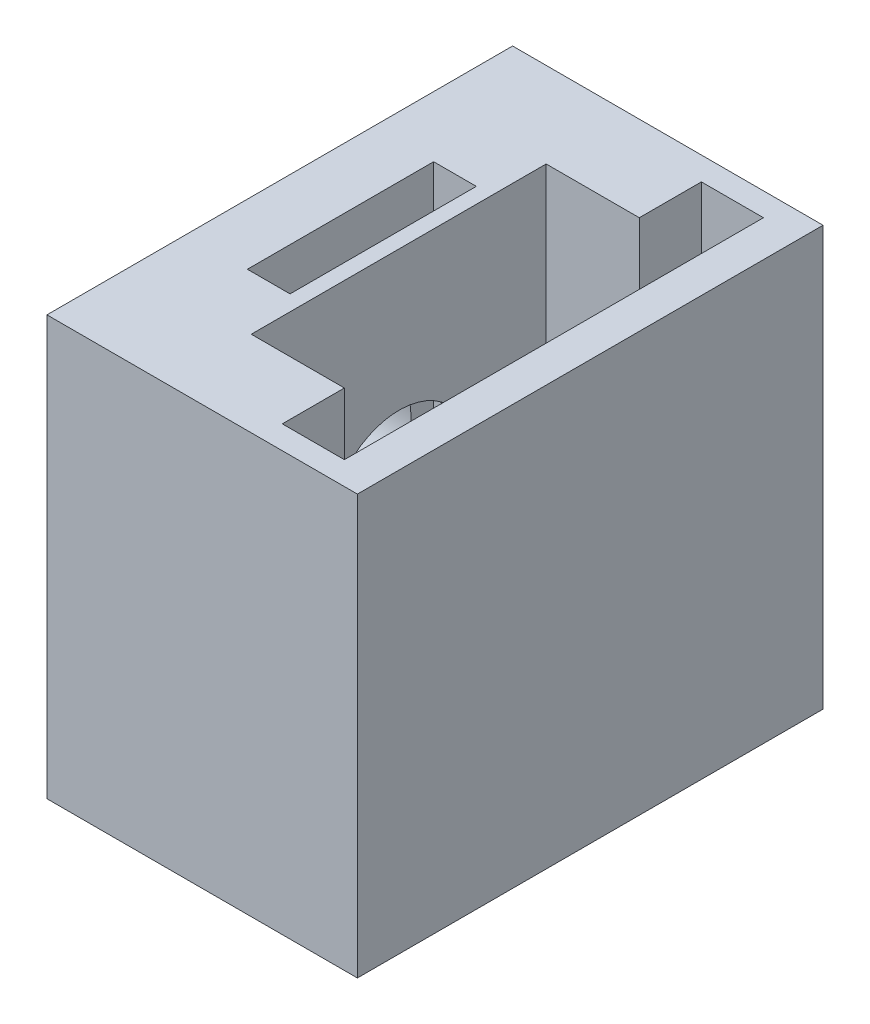
ISO-10303-21;
HEADER;
FILE_DESCRIPTION(('STEP AP214'),'2;1');
FILE_NAME('part.step','',(''),(''),'','','');
FILE_SCHEMA(('AUTOMOTIVE_DESIGN { 1 0 10303 214 1 1 1 1 }'));
ENDSEC;
DATA;
#1=APPLICATION_CONTEXT('core data for automotive mechanical design processes');
#2=APPLICATION_PROTOCOL_DEFINITION('international standard','automotive_design',2000,#1);
#3=PRODUCT_CONTEXT('',#1,'mechanical');
#4=PRODUCT('Part','Part','',(#3));
#5=PRODUCT_RELATED_PRODUCT_CATEGORY('part','',(#4));
#6=PRODUCT_DEFINITION_FORMATION('','',#4);
#7=PRODUCT_DEFINITION_CONTEXT('part definition',#1,'design');
#8=PRODUCT_DEFINITION('design','',#6,#7);
#9=PRODUCT_DEFINITION_SHAPE('','',#8);
#10=(LENGTH_UNIT() NAMED_UNIT(*) SI_UNIT(.MILLI.,.METRE.));
#11=(NAMED_UNIT(*) PLANE_ANGLE_UNIT() SI_UNIT($,.RADIAN.));
#12=(NAMED_UNIT(*) SI_UNIT($,.STERADIAN.) SOLID_ANGLE_UNIT());
#13=UNCERTAINTY_MEASURE_WITH_UNIT(LENGTH_MEASURE(1.E-05),#10,'distance_accuracy_value','');
#14=(GEOMETRIC_REPRESENTATION_CONTEXT(3) GLOBAL_UNCERTAINTY_ASSIGNED_CONTEXT((#13)) GLOBAL_UNIT_ASSIGNED_CONTEXT((#10,
#11,#12)) REPRESENTATION_CONTEXT('',''));
#15=CARTESIAN_POINT('',(0.,0.,0.));
#16=DIRECTION('',(0.,0.,1.));
#17=DIRECTION('',(1.,0.,0.));
#18=AXIS2_PLACEMENT_3D('',#15,#16,#17);
#19=CARTESIAN_POINT('',(0.,9.5,0.));
#20=DIRECTION('',(0.,1.,0.));
#21=DIRECTION('',(0.,0.,1.));
#22=AXIS2_PLACEMENT_3D('',#19,#20,#21);
#23=PLANE('',#22);
#24=DIRECTION('',(-1.,0.,0.));
#25=VECTOR('',#24,1.);
#26=CARTESIAN_POINT('',(10.5,9.5,-17.1015528128088));
#27=LINE('',#26,#25);
#28=CARTESIAN_POINT('',(6.66196126146727,9.5,-17.1015528128088));
#29=VERTEX_POINT('',#28);
#30=CARTESIAN_POINT('',(3.91196126146727,9.5,-17.1015528128088));
#31=VERTEX_POINT('',#30);
#32=EDGE_CURVE('E11',#29,#31,#27,.T.);
#33=ORIENTED_EDGE('',*,*,#32,.F.);
#34=DIRECTION('',(0.,0.,-1.));
#35=VECTOR('',#34,1.);
#36=CARTESIAN_POINT('',(6.66196126146727,9.5,-21.));
#37=LINE('',#36,#35);
#38=CARTESIAN_POINT('',(6.66196126146727,9.5,-21.));
#39=VERTEX_POINT('',#38);
#40=EDGE_CURVE('E173',#29,#39,#37,.T.);
#41=ORIENTED_EDGE('',*,*,#40,.T.);
#42=DIRECTION('',(-1.,0.,0.));
#43=VECTOR('',#42,1.);
#44=CARTESIAN_POINT('',(3.91196126146727,9.5,-21.));
#45=LINE('',#44,#43);
#46=CARTESIAN_POINT('',(3.91196126146727,9.5,-21.));
#47=VERTEX_POINT('',#46);
#48=EDGE_CURVE('E179',#39,#47,#45,.T.);
#49=ORIENTED_EDGE('',*,*,#48,.T.);
#50=DIRECTION('',(0.,0.,1.));
#51=VECTOR('',#50,1.);
#52=CARTESIAN_POINT('',(3.91196126146727,9.5,-21.));
#53=LINE('',#52,#51);
#54=EDGE_CURVE('E588',#47,#31,#53,.T.);
#55=ORIENTED_EDGE('',*,*,#54,.T.);
#56=EDGE_LOOP('',(#33,#41,#49,#55));
#57=FACE_BOUND('',#56,.T.);
#58=ADVANCED_FACE('F35',(#57),#23,.T.);
#59=CARTESIAN_POINT('',(20.,27.,0.));
#60=DIRECTION('',(0.,-1.,0.));
#61=DIRECTION('',(0.,0.,-1.));
#62=AXIS2_PLACEMENT_3D('',#59,#60,#61);
#63=PLANE('',#62);
#64=DIRECTION('',(1.,0.,0.));
#65=VECTOR('',#64,1.);
#66=CARTESIAN_POINT('',(3.91196126146727,27.,-8.99999999999999));
#67=LINE('',#66,#65);
#68=CARTESIAN_POINT('',(3.91196126146727,27.,-8.99999999999999));
#69=VERTEX_POINT('',#68);
#70=CARTESIAN_POINT('',(6.66196126146727,27.,-8.99999999999999));
#71=VERTEX_POINT('',#70);
#72=EDGE_CURVE('E188',#69,#71,#67,.T.);
#73=ORIENTED_EDGE('',*,*,#72,.F.);
#74=DIRECTION('',(0.,0.,1.));
#75=VECTOR('',#74,1.);
#76=CARTESIAN_POINT('',(3.91196126146727,27.,-21.));
#77=LINE('',#76,#75);
#78=CARTESIAN_POINT('',(3.91196126146727,27.,-21.));
#79=VERTEX_POINT('',#78);
#80=EDGE_CURVE('E57',#79,#69,#77,.T.);
#81=ORIENTED_EDGE('',*,*,#80,.F.);
#82=DIRECTION('',(-1.,0.,0.));
#83=VECTOR('',#82,1.);
#84=CARTESIAN_POINT('',(3.91196126146727,27.,-21.));
#85=LINE('',#84,#83);
#86=CARTESIAN_POINT('',(6.66196126146727,27.,-21.));
#87=VERTEX_POINT('',#86);
#88=EDGE_CURVE('E195',#87,#79,#85,.T.);
#89=ORIENTED_EDGE('',*,*,#88,.F.);
#90=DIRECTION('',(0.,0.,-1.));
#91=VECTOR('',#90,1.);
#92=CARTESIAN_POINT('',(6.66196126146727,27.,-21.));
#93=LINE('',#92,#91);
#94=EDGE_CURVE('E192',#71,#87,#93,.T.);
#95=ORIENTED_EDGE('',*,*,#94,.F.);
#96=EDGE_LOOP('',(#73,#81,#89,#95));
#97=FACE_BOUND('',#96,.T.);
#98=DIRECTION('',(0.,0.,1.));
#99=VECTOR('',#98,1.);
#100=CARTESIAN_POINT('',(0.,27.,0.));
#101=LINE('',#100,#99);
#102=CARTESIAN_POINT('',(0.,27.,-30.));
#103=VERTEX_POINT('',#102);
#104=CARTESIAN_POINT('',(0.,27.,0.));
#105=VERTEX_POINT('',#104);
#106=EDGE_CURVE('E279',#103,#105,#101,.T.);
#107=ORIENTED_EDGE('',*,*,#106,.T.);
#108=DIRECTION('',(-1.,0.,0.));
#109=VECTOR('',#108,1.);
#110=CARTESIAN_POINT('',(20.,27.,0.));
#111=LINE('',#110,#109);
#112=CARTESIAN_POINT('',(20.,27.,0.));
#113=VERTEX_POINT('',#112);
#114=EDGE_CURVE('E285',#113,#105,#111,.T.);
#115=ORIENTED_EDGE('',*,*,#114,.F.);
#116=DIRECTION('',(0.,0.,1.));
#117=VECTOR('',#116,1.);
#118=CARTESIAN_POINT('',(20.,27.,0.));
#119=LINE('',#118,#117);
#120=CARTESIAN_POINT('',(20.,27.,-30.));
#121=VERTEX_POINT('',#120);
#122=EDGE_CURVE('E283',#121,#113,#119,.T.);
#123=ORIENTED_EDGE('',*,*,#122,.F.);
#124=DIRECTION('',(-1.,0.,0.));
#125=VECTOR('',#124,1.);
#126=CARTESIAN_POINT('',(20.,27.,-30.));
#127=LINE('',#126,#125);
#128=EDGE_CURVE('E295',#121,#103,#127,.T.);
#129=ORIENTED_EDGE('',*,*,#128,.T.);
#130=EDGE_LOOP('',(#107,#115,#123,#129));
#131=FACE_BOUND('',#130,.T.);
#132=DIRECTION('',(0.,0.,1.));
#133=VECTOR('',#132,1.);
#134=CARTESIAN_POINT('',(7.66196126146727,27.,-24.5));
#135=LINE('',#134,#133);
#136=CARTESIAN_POINT('',(7.66196126146727,27.,-24.5));
#137=VERTEX_POINT('',#136);
#138=CARTESIAN_POINT('',(7.66196126146727,27.,-5.5));
#139=VERTEX_POINT('',#138);
#140=EDGE_CURVE('E210',#137,#139,#135,.T.);
#141=ORIENTED_EDGE('',*,*,#140,.F.);
#142=DIRECTION('',(-1.,0.,0.));
#143=VECTOR('',#142,1.);
#144=CARTESIAN_POINT('',(7.66196126146727,27.,-24.5));
#145=LINE('',#144,#143);
#146=CARTESIAN_POINT('',(13.6619612614673,27.,-24.5));
#147=VERTEX_POINT('',#146);
#148=EDGE_CURVE('E217',#147,#137,#145,.T.);
#149=ORIENTED_EDGE('',*,*,#148,.F.);
#150=DIRECTION('',(0.,0.,1.));
#151=VECTOR('',#150,1.);
#152=CARTESIAN_POINT('',(13.6619612614673,26.9999999999758,-28.5));
#153=LINE('',#152,#151);
#154=CARTESIAN_POINT('',(13.6619612614673,27.,-28.5));
#155=VERTEX_POINT('',#154);
#156=EDGE_CURVE('E244',#155,#147,#153,.T.);
#157=ORIENTED_EDGE('',*,*,#156,.F.);
#158=DIRECTION('',(1.,0.,0.));
#159=VECTOR('',#158,1.);
#160=CARTESIAN_POINT('',(13.6619612614673,26.9999999999758,-28.5));
#161=LINE('',#160,#159);
#162=CARTESIAN_POINT('',(17.6619612614673,26.9999999999758,-28.5));
#163=VERTEX_POINT('',#162);
#164=EDGE_CURVE('E233',#155,#163,#161,.T.);
#165=ORIENTED_EDGE('',*,*,#164,.T.);
#166=DIRECTION('',(0.,0.,1.));
#167=VECTOR('',#166,1.);
#168=CARTESIAN_POINT('',(17.6619612614673,26.9999999999758,-28.5));
#169=LINE('',#168,#167);
#170=CARTESIAN_POINT('',(17.6619612614673,26.9999999999758,-1.5));
#171=VERTEX_POINT('',#170);
#172=EDGE_CURVE('E255',#163,#171,#169,.T.);
#173=ORIENTED_EDGE('',*,*,#172,.T.);
#174=DIRECTION('',(1.,0.,0.));
#175=VECTOR('',#174,1.);
#176=CARTESIAN_POINT('',(13.6619612614673,26.9999999999758,-1.5));
#177=LINE('',#176,#175);
#178=CARTESIAN_POINT('',(13.6619612614673,26.9999999999758,-1.5));
#179=VERTEX_POINT('',#178);
#180=EDGE_CURVE('E258',#179,#171,#177,.T.);
#181=ORIENTED_EDGE('',*,*,#180,.F.);
#182=CARTESIAN_POINT('',(13.6619612614673,27.,-5.5));
#183=VERTEX_POINT('',#182);
#184=EDGE_CURVE('E261',#183,#179,#153,.T.);
#185=ORIENTED_EDGE('',*,*,#184,.F.);
#186=DIRECTION('',(1.,0.,0.));
#187=VECTOR('',#186,1.);
#188=CARTESIAN_POINT('',(7.66196126146727,27.,-5.5));
#189=LINE('',#188,#187);
#190=EDGE_CURVE('E227',#139,#183,#189,.T.);
#191=ORIENTED_EDGE('',*,*,#190,.F.);
#192=EDGE_LOOP('',(#141,#149,#157,#165,#173,#181,#185,#191));
#193=FACE_BOUND('',#192,.T.);
#194=ADVANCED_FACE('F320',(#97,#131,#193),#63,.F.);
#195=CARTESIAN_POINT('',(20.,0.,0.));
#196=DIRECTION('',(0.,0.,-1.));
#197=DIRECTION('',(0.,1.,0.));
#198=AXIS2_PLACEMENT_3D('',#195,#196,#197);
#199=PLANE('',#198);
#200=DIRECTION('',(0.,-1.,0.));
#201=VECTOR('',#200,1.);
#202=CARTESIAN_POINT('',(0.,0.,0.));
#203=LINE('',#202,#201);
#204=CARTESIAN_POINT('',(0.,0.,0.));
#205=VERTEX_POINT('',#204);
#206=EDGE_CURVE('E274',#105,#205,#203,.T.);
#207=ORIENTED_EDGE('',*,*,#206,.T.);
#208=DIRECTION('',(-1.,0.,0.));
#209=VECTOR('',#208,1.);
#210=CARTESIAN_POINT('',(20.,0.,0.));
#211=LINE('',#210,#209);
#212=CARTESIAN_POINT('',(20.,0.,0.));
#213=VERTEX_POINT('',#212);
#214=EDGE_CURVE('E165',#213,#205,#211,.T.);
#215=ORIENTED_EDGE('',*,*,#214,.F.);
#216=DIRECTION('',(0.,-1.,0.));
#217=VECTOR('',#216,1.);
#218=CARTESIAN_POINT('',(20.,0.,0.));
#219=LINE('',#218,#217);
#220=EDGE_CURVE('E275',#113,#213,#219,.T.);
#221=ORIENTED_EDGE('',*,*,#220,.F.);
#222=ORIENTED_EDGE('',*,*,#114,.T.);
#223=EDGE_LOOP('',(#207,#215,#221,#222));
#224=FACE_BOUND('',#223,.T.);
#225=ADVANCED_FACE('F37',(#224),#199,.F.);
#226=CARTESIAN_POINT('',(20.,0.,0.));
#227=DIRECTION('',(0.,1.,0.));
#228=DIRECTION('',(0.,0.,1.));
#229=AXIS2_PLACEMENT_3D('',#226,#227,#228);
#230=PLANE('',#229);
#231=DIRECTION('',(0.,0.,-1.));
#232=VECTOR('',#231,1.);
#233=CARTESIAN_POINT('',(0.,0.,0.));
#234=LINE('',#233,#232);
#235=CARTESIAN_POINT('',(0.,0.,-30.));
#236=VERTEX_POINT('',#235);
#237=EDGE_CURVE('E288',#205,#236,#234,.T.);
#238=ORIENTED_EDGE('',*,*,#237,.T.);
#239=DIRECTION('',(-1.,0.,0.));
#240=VECTOR('',#239,1.);
#241=CARTESIAN_POINT('',(20.,0.,-30.));
#242=LINE('',#241,#240);
#243=CARTESIAN_POINT('',(20.,0.,-30.));
#244=VERTEX_POINT('',#243);
#245=EDGE_CURVE('E298',#244,#236,#242,.T.);
#246=ORIENTED_EDGE('',*,*,#245,.F.);
#247=DIRECTION('',(0.,0.,-1.));
#248=VECTOR('',#247,1.);
#249=CARTESIAN_POINT('',(20.,0.,0.));
#250=LINE('',#249,#248);
#251=EDGE_CURVE('E278',#213,#244,#250,.T.);
#252=ORIENTED_EDGE('',*,*,#251,.F.);
#253=ORIENTED_EDGE('',*,*,#214,.T.);
#254=EDGE_LOOP('',(#238,#246,#252,#253));
#255=FACE_BOUND('',#254,.T.);
#256=ADVANCED_FACE('F304',(#255),#230,.F.);
#257=CARTESIAN_POINT('',(20.,0.,-30.));
#258=DIRECTION('',(0.,0.,1.));
#259=DIRECTION('',(1.,0.,0.));
#260=AXIS2_PLACEMENT_3D('',#257,#258,#259);
#261=PLANE('',#260);
#262=DIRECTION('',(0.,1.,0.));
#263=VECTOR('',#262,1.);
#264=CARTESIAN_POINT('',(0.,0.,-30.));
#265=LINE('',#264,#263);
#266=EDGE_CURVE('E290',#236,#103,#265,.T.);
#267=ORIENTED_EDGE('',*,*,#266,.T.);
#268=ORIENTED_EDGE('',*,*,#128,.F.);
#269=DIRECTION('',(0.,1.,0.));
#270=VECTOR('',#269,1.);
#271=CARTESIAN_POINT('',(20.,0.,-30.));
#272=LINE('',#271,#270);
#273=EDGE_CURVE('E281',#244,#121,#272,.T.);
#274=ORIENTED_EDGE('',*,*,#273,.F.);
#275=ORIENTED_EDGE('',*,*,#245,.T.);
#276=EDGE_LOOP('',(#267,#268,#274,#275));
#277=FACE_BOUND('',#276,.T.);
#278=ADVANCED_FACE('F316',(#277),#261,.F.);
#279=CARTESIAN_POINT('',(20.,0.,0.));
#280=DIRECTION('',(-1.,0.,0.));
#281=DIRECTION('',(0.,0.,1.));
#282=AXIS2_PLACEMENT_3D('',#279,#280,#281);
#283=PLANE('',#282);
#284=ORIENTED_EDGE('',*,*,#220,.T.);
#285=ORIENTED_EDGE('',*,*,#251,.T.);
#286=ORIENTED_EDGE('',*,*,#273,.T.);
#287=ORIENTED_EDGE('',*,*,#122,.T.);
#288=EDGE_LOOP('',(#284,#285,#286,#287));
#289=FACE_BOUND('',#288,.T.);
#290=ADVANCED_FACE('F323',(#289),#283,.F.);
#291=CARTESIAN_POINT('',(0.,0.,0.));
#292=DIRECTION('',(-1.,0.,0.));
#293=DIRECTION('',(0.,0.,1.));
#294=AXIS2_PLACEMENT_3D('',#291,#292,#293);
#295=PLANE('',#294);
#296=CARTESIAN_POINT('',(0.,13.5,-15.1));
#297=DIRECTION('',(-1.,0.,0.));
#298=DIRECTION('',(0.,0.,1.));
#299=AXIS2_PLACEMENT_3D('',#296,#297,#298);
#300=CIRCLE('',#299,5.);
#301=CARTESIAN_POINT('',(0.,13.5,-10.1));
#302=VERTEX_POINT('',#301);
#303=EDGE_CURVE('E201',#302,#302,#300,.T.);
#304=ORIENTED_EDGE('',*,*,#303,.F.);
#305=EDGE_LOOP('',(#304));
#306=FACE_BOUND('',#305,.T.);
#307=ORIENTED_EDGE('',*,*,#206,.F.);
#308=ORIENTED_EDGE('',*,*,#106,.F.);
#309=ORIENTED_EDGE('',*,*,#266,.F.);
#310=ORIENTED_EDGE('',*,*,#237,.F.);
#311=EDGE_LOOP('',(#307,#308,#309,#310));
#312=FACE_BOUND('',#311,.T.);
#313=ADVANCED_FACE('F312',(#306,#312),#295,.T.);
#314=CARTESIAN_POINT('',(13.6619612614673,0.999999999975808,-28.5));
#315=DIRECTION('',(0.,0.,1.));
#316=DIRECTION('',(1.,0.,0.));
#317=AXIS2_PLACEMENT_3D('',#314,#315,#316);
#318=PLANE('',#317);
#319=ORIENTED_EDGE('',*,*,#164,.F.);
#320=DIRECTION('',(0.,1.,0.));
#321=VECTOR('',#320,1.);
#322=CARTESIAN_POINT('',(13.6619612614673,0.999999999975808,-28.5));
#323=LINE('',#322,#321);
#324=CARTESIAN_POINT('',(13.6619612614673,0.999999999975808,-28.5));
#325=VERTEX_POINT('',#324);
#326=EDGE_CURVE('E252',#325,#155,#323,.T.);
#327=ORIENTED_EDGE('',*,*,#326,.F.);
#328=DIRECTION('',(1.,0.,0.));
#329=VECTOR('',#328,1.);
#330=CARTESIAN_POINT('',(13.6619612614673,0.999999999975808,-28.5));
#331=LINE('',#330,#329);
#332=CARTESIAN_POINT('',(17.6619612614673,0.999999999975808,-28.5));
#333=VERTEX_POINT('',#332);
#334=EDGE_CURVE('E240',#325,#333,#331,.T.);
#335=ORIENTED_EDGE('',*,*,#334,.T.);
#336=DIRECTION('',(0.,1.,0.));
#337=VECTOR('',#336,1.);
#338=CARTESIAN_POINT('',(17.6619612614673,0.999999999975808,-28.5));
#339=LINE('',#338,#337);
#340=EDGE_CURVE('E271',#333,#163,#339,.T.);
#341=ORIENTED_EDGE('',*,*,#340,.T.);
#342=EDGE_LOOP('',(#319,#327,#335,#341));
#343=FACE_BOUND('',#342,.T.);
#344=ADVANCED_FACE('F330',(#343),#318,.T.);
#345=CARTESIAN_POINT('',(17.6619612614673,0.999999999975808,-28.5));
#346=DIRECTION('',(-1.,0.,0.));
#347=DIRECTION('',(0.,0.,1.));
#348=AXIS2_PLACEMENT_3D('',#345,#346,#347);
#349=PLANE('',#348);
#350=ORIENTED_EDGE('',*,*,#172,.F.);
#351=ORIENTED_EDGE('',*,*,#340,.F.);
#352=DIRECTION('',(0.,0.,1.));
#353=VECTOR('',#352,1.);
#354=CARTESIAN_POINT('',(17.6619612614673,0.999999999975808,-28.5));
#355=LINE('',#354,#353);
#356=CARTESIAN_POINT('',(17.6619612614673,0.999999999975808,-1.5));
#357=VERTEX_POINT('',#356);
#358=EDGE_CURVE('E243',#333,#357,#355,.T.);
#359=ORIENTED_EDGE('',*,*,#358,.T.);
#360=DIRECTION('',(0.,1.,0.));
#361=VECTOR('',#360,1.);
#362=CARTESIAN_POINT('',(17.6619612614673,0.999999999975808,-1.5));
#363=LINE('',#362,#361);
#364=EDGE_CURVE('E269',#357,#171,#363,.T.);
#365=ORIENTED_EDGE('',*,*,#364,.T.);
#366=EDGE_LOOP('',(#350,#351,#359,#365));
#367=FACE_BOUND('',#366,.T.);
#368=ADVANCED_FACE('F398',(#367),#349,.T.);
#369=CARTESIAN_POINT('',(13.6619612614673,0.999999999975808,-1.5));
#370=DIRECTION('',(0.,0.,1.));
#371=DIRECTION('',(1.,0.,0.));
#372=AXIS2_PLACEMENT_3D('',#369,#370,#371);
#373=PLANE('',#372);
#374=ORIENTED_EDGE('',*,*,#180,.T.);
#375=ORIENTED_EDGE('',*,*,#364,.F.);
#376=DIRECTION('',(1.,0.,0.));
#377=VECTOR('',#376,1.);
#378=CARTESIAN_POINT('',(13.6619612614673,0.999999999975808,-1.5));
#379=LINE('',#378,#377);
#380=CARTESIAN_POINT('',(13.6619612614673,0.999999999975808,-1.5));
#381=VERTEX_POINT('',#380);
#382=EDGE_CURVE('E246',#381,#357,#379,.T.);
#383=ORIENTED_EDGE('',*,*,#382,.F.);
#384=DIRECTION('',(0.,1.,0.));
#385=VECTOR('',#384,1.);
#386=CARTESIAN_POINT('',(13.6619612614673,0.999999999975808,-1.5));
#387=LINE('',#386,#385);
#388=EDGE_CURVE('E266',#381,#179,#387,.T.);
#389=ORIENTED_EDGE('',*,*,#388,.T.);
#390=EDGE_LOOP('',(#374,#375,#383,#389));
#391=FACE_BOUND('',#390,.T.);
#392=ADVANCED_FACE('F394',(#391),#373,.F.);
#393=CARTESIAN_POINT('',(13.6619612614673,0.999999999975808,-28.5));
#394=DIRECTION('',(-1.,0.,0.));
#395=DIRECTION('',(0.,0.,1.));
#396=AXIS2_PLACEMENT_3D('',#393,#394,#395);
#397=PLANE('',#396);
#398=ORIENTED_EDGE('',*,*,#156,.T.);
#399=DIRECTION('',(0.,1.,0.));
#400=VECTOR('',#399,1.);
#401=CARTESIAN_POINT('',(13.6619612614673,7.,-24.5));
#402=LINE('',#401,#400);
#403=CARTESIAN_POINT('',(13.6619612614673,7.,-24.5));
#404=VERTEX_POINT('',#403);
#405=EDGE_CURVE('E234',#404,#147,#402,.T.);
#406=ORIENTED_EDGE('',*,*,#405,.F.);
#407=DIRECTION('',(0.,0.,-1.));
#408=VECTOR('',#407,1.);
#409=CARTESIAN_POINT('',(13.6619612614673,7.,-24.5));
#410=LINE('',#409,#408);
#411=CARTESIAN_POINT('',(13.6619612614673,7.,-5.5));
#412=VERTEX_POINT('',#411);
#413=EDGE_CURVE('E219',#412,#404,#410,.T.);
#414=ORIENTED_EDGE('',*,*,#413,.F.);
#415=DIRECTION('',(0.,1.,0.));
#416=VECTOR('',#415,1.);
#417=CARTESIAN_POINT('',(13.6619612614673,7.,-5.5));
#418=LINE('',#417,#416);
#419=EDGE_CURVE('E236',#412,#183,#418,.T.);
#420=ORIENTED_EDGE('',*,*,#419,.T.);
#421=ORIENTED_EDGE('',*,*,#184,.T.);
#422=ORIENTED_EDGE('',*,*,#388,.F.);
#423=DIRECTION('',(0.,0.,1.));
#424=VECTOR('',#423,1.);
#425=CARTESIAN_POINT('',(13.6619612614673,0.999999999975808,-28.5));
#426=LINE('',#425,#424);
#427=EDGE_CURVE('E249',#325,#381,#426,.T.);
#428=ORIENTED_EDGE('',*,*,#427,.F.);
#429=ORIENTED_EDGE('',*,*,#326,.T.);
#430=EDGE_LOOP('',(#398,#406,#414,#420,#421,#422,#428,#429));
#431=FACE_BOUND('',#430,.T.);
#432=ADVANCED_FACE('F390',(#431),#397,.F.);
#433=CARTESIAN_POINT('',(0.,0.999999999975808,0.));
#434=DIRECTION('',(0.,-1.,0.));
#435=DIRECTION('',(0.,0.,-1.));
#436=AXIS2_PLACEMENT_3D('',#433,#434,#435);
#437=PLANE('',#436);
#438=ORIENTED_EDGE('',*,*,#334,.F.);
#439=ORIENTED_EDGE('',*,*,#427,.T.);
#440=ORIENTED_EDGE('',*,*,#382,.T.);
#441=ORIENTED_EDGE('',*,*,#358,.F.);
#442=EDGE_LOOP('',(#438,#439,#440,#441));
#443=FACE_BOUND('',#442,.T.);
#444=ADVANCED_FACE('F386',(#443),#437,.F.);
#445=CARTESIAN_POINT('',(7.66196126146727,7.,-24.5));
#446=DIRECTION('',(-1.,0.,0.));
#447=DIRECTION('',(0.,0.,1.));
#448=AXIS2_PLACEMENT_3D('',#445,#446,#447);
#449=PLANE('',#448);
#450=CARTESIAN_POINT('',(7.66196126146727,13.5,-15.04));
#451=DIRECTION('',(-1.,0.,0.));
#452=DIRECTION('',(0.,0.,1.));
#453=AXIS2_PLACEMENT_3D('',#450,#451,#452);
#454=CIRCLE('',#453,4.5);
#455=CARTESIAN_POINT('',(7.66196126146727,13.5,-10.54));
#456=VERTEX_POINT('',#455);
#457=EDGE_CURVE('E189',#456,#456,#454,.T.);
#458=ORIENTED_EDGE('',*,*,#457,.T.);
#459=EDGE_LOOP('',(#458));
#460=FACE_BOUND('',#459,.T.);
#461=ORIENTED_EDGE('',*,*,#140,.T.);
#462=DIRECTION('',(0.,1.,0.));
#463=VECTOR('',#462,1.);
#464=CARTESIAN_POINT('',(7.66196126146727,7.,-5.5));
#465=LINE('',#464,#463);
#466=CARTESIAN_POINT('',(7.66196126146727,7.,-5.5));
#467=VERTEX_POINT('',#466);
#468=EDGE_CURVE('E224',#467,#139,#465,.T.);
#469=ORIENTED_EDGE('',*,*,#468,.F.);
#470=DIRECTION('',(0.,0.,1.));
#471=VECTOR('',#470,1.);
#472=CARTESIAN_POINT('',(7.66196126146727,7.,-24.5));
#473=LINE('',#472,#471);
#474=CARTESIAN_POINT('',(7.66196126146727,7.,-24.5));
#475=VERTEX_POINT('',#474);
#476=EDGE_CURVE('E213',#475,#467,#473,.T.);
#477=ORIENTED_EDGE('',*,*,#476,.F.);
#478=DIRECTION('',(0.,1.,0.));
#479=VECTOR('',#478,1.);
#480=CARTESIAN_POINT('',(7.66196126146727,7.,-24.5));
#481=LINE('',#480,#479);
#482=EDGE_CURVE('E231',#475,#137,#481,.T.);
#483=ORIENTED_EDGE('',*,*,#482,.T.);
#484=EDGE_LOOP('',(#461,#469,#477,#483));
#485=FACE_BOUND('',#484,.T.);
#486=ADVANCED_FACE('F379',(#460,#485),#449,.F.);
#487=CARTESIAN_POINT('',(7.66196126146727,7.,-24.5));
#488=DIRECTION('',(0.,0.,-1.));
#489=DIRECTION('',(-1.,0.,0.));
#490=AXIS2_PLACEMENT_3D('',#487,#488,#489);
#491=PLANE('',#490);
#492=ORIENTED_EDGE('',*,*,#148,.T.);
#493=ORIENTED_EDGE('',*,*,#482,.F.);
#494=DIRECTION('',(-1.,0.,0.));
#495=VECTOR('',#494,1.);
#496=CARTESIAN_POINT('',(7.66196126146727,7.,-24.5));
#497=LINE('',#496,#495);
#498=EDGE_CURVE('E221',#404,#475,#497,.T.);
#499=ORIENTED_EDGE('',*,*,#498,.F.);
#500=ORIENTED_EDGE('',*,*,#405,.T.);
#501=EDGE_LOOP('',(#492,#493,#499,#500));
#502=FACE_BOUND('',#501,.T.);
#503=ADVANCED_FACE('F376',(#502),#491,.F.);
#504=CARTESIAN_POINT('',(7.66196126146727,7.,-5.5));
#505=DIRECTION('',(0.,0.,1.));
#506=DIRECTION('',(1.,0.,0.));
#507=AXIS2_PLACEMENT_3D('',#504,#505,#506);
#508=PLANE('',#507);
#509=ORIENTED_EDGE('',*,*,#190,.T.);
#510=ORIENTED_EDGE('',*,*,#419,.F.);
#511=DIRECTION('',(1.,0.,0.));
#512=VECTOR('',#511,1.);
#513=CARTESIAN_POINT('',(7.66196126146727,7.,-5.5));
#514=LINE('',#513,#512);
#515=EDGE_CURVE('E216',#467,#412,#514,.T.);
#516=ORIENTED_EDGE('',*,*,#515,.F.);
#517=ORIENTED_EDGE('',*,*,#468,.T.);
#518=EDGE_LOOP('',(#509,#510,#516,#517));
#519=FACE_BOUND('',#518,.T.);
#520=ADVANCED_FACE('F374',(#519),#508,.F.);
#521=CARTESIAN_POINT('',(0.,7.,0.));
#522=DIRECTION('',(0.,1.,0.));
#523=DIRECTION('',(0.,0.,1.));
#524=AXIS2_PLACEMENT_3D('',#521,#522,#523);
#525=PLANE('',#524);
#526=ORIENTED_EDGE('',*,*,#476,.T.);
#527=ORIENTED_EDGE('',*,*,#515,.T.);
#528=ORIENTED_EDGE('',*,*,#413,.T.);
#529=ORIENTED_EDGE('',*,*,#498,.T.);
#530=EDGE_LOOP('',(#526,#527,#528,#529));
#531=FACE_BOUND('',#530,.T.);
#532=ADVANCED_FACE('F370',(#531),#525,.T.);
#533=CARTESIAN_POINT('',(0.5,13.5,-15.1));
#534=DIRECTION('',(-1.,0.,0.));
#535=DIRECTION('',(0.,0.,1.));
#536=AXIS2_PLACEMENT_3D('',#533,#534,#535);
#537=CYLINDRICAL_SURFACE('',#536,5.);
#538=CARTESIAN_POINT('',(0.5,13.5,-15.1));
#539=DIRECTION('',(-1.,0.,0.));
#540=DIRECTION('',(0.,0.,1.));
#541=AXIS2_PLACEMENT_3D('',#538,#539,#540);
#542=CIRCLE('',#541,5.);
#543=CARTESIAN_POINT('',(0.5,13.5,-10.1));
#544=VERTEX_POINT('',#543);
#545=EDGE_CURVE('E207',#544,#544,#542,.T.);
#546=ORIENTED_EDGE('',*,*,#545,.F.);
#547=EDGE_LOOP('',(#546));
#548=FACE_BOUND('',#547,.T.);
#549=ORIENTED_EDGE('',*,*,#303,.T.);
#550=EDGE_LOOP('',(#549));
#551=FACE_BOUND('',#550,.T.);
#552=ADVANCED_FACE('F366',(#548,#551),#537,.F.);
#553=CARTESIAN_POINT('',(0.5,13.5,-15.1));
#554=DIRECTION('',(-1.,0.,0.));
#555=DIRECTION('',(0.,0.,1.));
#556=AXIS2_PLACEMENT_3D('',#553,#554,#555);
#557=PLANE('',#556);
#558=CARTESIAN_POINT('',(0.5,13.5,-15.04));
#559=DIRECTION('',(-1.,0.,0.));
#560=DIRECTION('',(0.,0.,1.));
#561=AXIS2_PLACEMENT_3D('',#558,#559,#560);
#562=CIRCLE('',#561,4.5);
#563=CARTESIAN_POINT('',(0.5,13.5,-10.54));
#564=VERTEX_POINT('',#563);
#565=EDGE_CURVE('E174',#564,#564,#562,.T.);
#566=ORIENTED_EDGE('',*,*,#565,.F.);
#567=EDGE_LOOP('',(#566));
#568=FACE_BOUND('',#567,.T.);
#569=ORIENTED_EDGE('',*,*,#545,.T.);
#570=EDGE_LOOP('',(#569));
#571=FACE_BOUND('',#570,.T.);
#572=ADVANCED_FACE('F363',(#568,#571),#557,.T.);
#573=CARTESIAN_POINT('',(3.91196126146727,9.5,-21.));
#574=DIRECTION('',(-1.,0.,0.));
#575=DIRECTION('',(0.,0.,1.));
#576=AXIS2_PLACEMENT_3D('',#573,#574,#575);
#577=PLANE('',#576);
#578=CARTESIAN_POINT('',(3.91196126146727,9.5,-12.9784471871912));
#579=VERTEX_POINT('',#578);
#580=CARTESIAN_POINT('',(3.91196126146727,9.5,-8.99999999999999));
#581=VERTEX_POINT('',#580);
#582=EDGE_CURVE('E198',#579,#581,#53,.T.);
#583=ORIENTED_EDGE('',*,*,#582,.F.);
#584=CARTESIAN_POINT('',(3.91196126146727,13.5,-15.04));
#585=DIRECTION('',(-1.,0.,0.));
#586=DIRECTION('',(0.,0.,1.));
#587=AXIS2_PLACEMENT_3D('',#584,#585,#586);
#588=CIRCLE('',#587,4.5);
#589=EDGE_CURVE('E49',#579,#31,#588,.T.);
#590=ORIENTED_EDGE('',*,*,#589,.T.);
#591=ORIENTED_EDGE('',*,*,#54,.F.);
#592=DIRECTION('',(0.,1.,0.));
#593=VECTOR('',#592,1.);
#594=CARTESIAN_POINT('',(3.91196126146727,9.5,-21.));
#595=LINE('',#594,#593);
#596=EDGE_CURVE('E199',#47,#79,#595,.T.);
#597=ORIENTED_EDGE('',*,*,#596,.T.);
#598=ORIENTED_EDGE('',*,*,#80,.T.);
#599=DIRECTION('',(0.,1.,0.));
#600=VECTOR('',#599,1.);
#601=CARTESIAN_POINT('',(3.91196126146727,9.5,-8.99999999999999));
#602=LINE('',#601,#600);
#603=EDGE_CURVE('E182',#581,#69,#602,.T.);
#604=ORIENTED_EDGE('',*,*,#603,.F.);
#605=EDGE_LOOP('',(#583,#590,#591,#597,#598,#604));
#606=FACE_BOUND('',#605,.T.);
#607=ADVANCED_FACE('F360',(#606),#577,.F.);
#608=CARTESIAN_POINT('',(3.91196126146727,9.5,-21.));
#609=DIRECTION('',(0.,0.,-1.));
#610=DIRECTION('',(-1.,0.,0.));
#611=AXIS2_PLACEMENT_3D('',#608,#609,#610);
#612=PLANE('',#611);
#613=ORIENTED_EDGE('',*,*,#88,.T.);
#614=ORIENTED_EDGE('',*,*,#596,.F.);
#615=ORIENTED_EDGE('',*,*,#48,.F.);
#616=DIRECTION('',(0.,1.,0.));
#617=VECTOR('',#616,1.);
#618=CARTESIAN_POINT('',(6.66196126146727,9.5,-21.));
#619=LINE('',#618,#617);
#620=EDGE_CURVE('E202',#39,#87,#619,.T.);
#621=ORIENTED_EDGE('',*,*,#620,.T.);
#622=EDGE_LOOP('',(#613,#614,#615,#621));
#623=FACE_BOUND('',#622,.T.);
#624=ADVANCED_FACE('F357',(#623),#612,.F.);
#625=CARTESIAN_POINT('',(6.66196126146727,9.5,-21.));
#626=DIRECTION('',(1.,0.,0.));
#627=DIRECTION('',(0.,0.,-1.));
#628=AXIS2_PLACEMENT_3D('',#625,#626,#627);
#629=PLANE('',#628);
#630=ORIENTED_EDGE('',*,*,#40,.F.);
#631=CARTESIAN_POINT('',(6.66196126146727,13.5,-15.04));
#632=DIRECTION('',(1.,0.,0.));
#633=DIRECTION('',(0.,0.,-1.));
#634=AXIS2_PLACEMENT_3D('',#631,#632,#633);
#635=CIRCLE('',#634,4.5);
#636=CARTESIAN_POINT('',(6.66196126146727,9.5,-12.9784471871912));
#637=VERTEX_POINT('',#636);
#638=EDGE_CURVE('E160',#29,#637,#635,.T.);
#639=ORIENTED_EDGE('',*,*,#638,.T.);
#640=CARTESIAN_POINT('',(6.66196126146727,9.5,-8.99999999999999));
#641=VERTEX_POINT('',#640);
#642=EDGE_CURVE('E170',#641,#637,#37,.T.);
#643=ORIENTED_EDGE('',*,*,#642,.F.);
#644=DIRECTION('',(0.,1.,0.));
#645=VECTOR('',#644,1.);
#646=CARTESIAN_POINT('',(6.66196126146727,9.5,-8.99999999999999));
#647=LINE('',#646,#645);
#648=EDGE_CURVE('E204',#641,#71,#647,.T.);
#649=ORIENTED_EDGE('',*,*,#648,.T.);
#650=ORIENTED_EDGE('',*,*,#94,.T.);
#651=ORIENTED_EDGE('',*,*,#620,.F.);
#652=EDGE_LOOP('',(#630,#639,#643,#649,#650,#651));
#653=FACE_BOUND('',#652,.T.);
#654=ADVANCED_FACE('F169',(#653),#629,.F.);
#655=CARTESIAN_POINT('',(3.91196126146727,9.5,-8.99999999999999));
#656=DIRECTION('',(0.,0.,1.));
#657=DIRECTION('',(1.,0.,0.));
#658=AXIS2_PLACEMENT_3D('',#655,#656,#657);
#659=PLANE('',#658);
#660=ORIENTED_EDGE('',*,*,#72,.T.);
#661=ORIENTED_EDGE('',*,*,#648,.F.);
#662=DIRECTION('',(1.,0.,0.));
#663=VECTOR('',#662,1.);
#664=CARTESIAN_POINT('',(3.91196126146727,9.5,-8.99999999999999));
#665=LINE('',#664,#663);
#666=EDGE_CURVE('E178',#581,#641,#665,.T.);
#667=ORIENTED_EDGE('',*,*,#666,.F.);
#668=ORIENTED_EDGE('',*,*,#603,.T.);
#669=EDGE_LOOP('',(#660,#661,#667,#668));
#670=FACE_BOUND('',#669,.T.);
#671=ADVANCED_FACE('F346',(#670),#659,.F.);
#672=DIRECTION('',(-1.,0.,0.));
#673=VECTOR('',#672,1.);
#674=CARTESIAN_POINT('',(10.5,9.5,-12.9784471871912));
#675=LINE('',#674,#673);
#676=EDGE_CURVE('E43',#579,#637,#675,.F.);
#677=ORIENTED_EDGE('',*,*,#676,.F.);
#678=ORIENTED_EDGE('',*,*,#582,.T.);
#679=ORIENTED_EDGE('',*,*,#666,.T.);
#680=ORIENTED_EDGE('',*,*,#642,.T.);
#681=EDGE_LOOP('',(#677,#678,#679,#680));
#682=FACE_BOUND('',#681,.T.);
#683=ADVANCED_FACE('F176',(#682),#23,.T.);
#684=CARTESIAN_POINT('',(10.5,13.5,-15.04));
#685=DIRECTION('',(-1.,0.,0.));
#686=DIRECTION('',(0.,0.,1.));
#687=AXIS2_PLACEMENT_3D('',#684,#685,#686);
#688=CYLINDRICAL_SURFACE('',#687,4.5);
#689=ORIENTED_EDGE('',*,*,#565,.T.);
#690=EDGE_LOOP('',(#689));
#691=FACE_BOUND('',#690,.T.);
#692=ORIENTED_EDGE('',*,*,#32,.T.);
#693=ORIENTED_EDGE('',*,*,#589,.F.);
#694=ORIENTED_EDGE('',*,*,#676,.T.);
#695=ORIENTED_EDGE('',*,*,#638,.F.);
#696=EDGE_LOOP('',(#692,#693,#694,#695));
#697=FACE_BOUND('',#696,.T.);
#698=ORIENTED_EDGE('',*,*,#457,.F.);
#699=EDGE_LOOP('',(#698));
#700=FACE_BOUND('',#699,.T.);
#701=ADVANCED_FACE('F158',(#691,#697,#700),#688,.F.);
#702=CLOSED_SHELL('',(#58,#194,#225,#256,#278,#290,#313,#344,#368,#392,#432,#444,#486,#503,#520,
#532,#552,#572,#607,#624,#654,#671,#683,#701));
#703=MANIFOLD_SOLID_BREP('B2',#702);
#704=ADVANCED_BREP_SHAPE_REPRESENTATION('',(#18,#703),#14);
#705=SHAPE_DEFINITION_REPRESENTATION(#9,#704);
ENDSEC;
END-ISO-10303-21;
